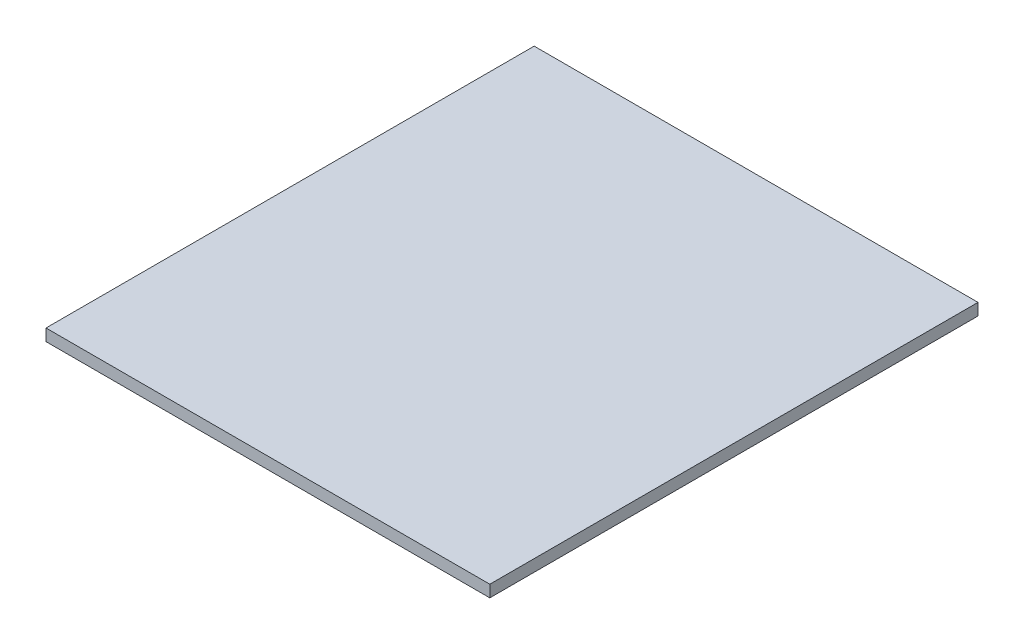
ISO-10303-21;
HEADER;
FILE_DESCRIPTION(('STEP AP214'),'2;1');
FILE_NAME('part.step','',(''),(''),'','','');
FILE_SCHEMA(('AUTOMOTIVE_DESIGN { 1 0 10303 214 1 1 1 1 }'));
ENDSEC;
DATA;
#1=APPLICATION_CONTEXT('core data for automotive mechanical design processes');
#2=APPLICATION_PROTOCOL_DEFINITION('international standard','automotive_design',2000,#1);
#3=PRODUCT_CONTEXT('',#1,'mechanical');
#4=PRODUCT('Part','Part','',(#3));
#5=PRODUCT_RELATED_PRODUCT_CATEGORY('part','',(#4));
#6=PRODUCT_DEFINITION_FORMATION('','',#4);
#7=PRODUCT_DEFINITION_CONTEXT('part definition',#1,'design');
#8=PRODUCT_DEFINITION('design','',#6,#7);
#9=PRODUCT_DEFINITION_SHAPE('','',#8);
#10=(LENGTH_UNIT() NAMED_UNIT(*) SI_UNIT(.MILLI.,.METRE.));
#11=(NAMED_UNIT(*) PLANE_ANGLE_UNIT() SI_UNIT($,.RADIAN.));
#12=(NAMED_UNIT(*) SI_UNIT($,.STERADIAN.) SOLID_ANGLE_UNIT());
#13=UNCERTAINTY_MEASURE_WITH_UNIT(LENGTH_MEASURE(1.E-05),#10,'distance_accuracy_value','');
#14=(GEOMETRIC_REPRESENTATION_CONTEXT(3) GLOBAL_UNCERTAINTY_ASSIGNED_CONTEXT((#13)) GLOBAL_UNIT_ASSIGNED_CONTEXT((#10,
#11,#12)) REPRESENTATION_CONTEXT('',''));
#15=CARTESIAN_POINT('',(0.,0.,0.));
#16=DIRECTION('',(0.,0.,1.));
#17=DIRECTION('',(1.,0.,0.));
#18=AXIS2_PLACEMENT_3D('',#15,#16,#17);
#19=CARTESIAN_POINT('',(50.,4.,0.));
#20=DIRECTION('',(-1.,0.,0.));
#21=DIRECTION('',(0.,0.,1.));
#22=AXIS2_PLACEMENT_3D('',#19,#20,#21);
#23=PLANE('',#22);
#24=DIRECTION('',(0.,1.,0.));
#25=VECTOR('',#24,1.);
#26=CARTESIAN_POINT('',(50.,4.,-510.));
#27=LINE('',#26,#25);
#28=CARTESIAN_POINT('',(50.,4.,-510.));
#29=VERTEX_POINT('',#28);
#30=CARTESIAN_POINT('',(50.,8.,-510.));
#31=VERTEX_POINT('',#30);
#32=EDGE_CURVE('E11',#29,#31,#27,.T.);
#33=ORIENTED_EDGE('',*,*,#32,.F.);
#34=DIRECTION('',(0.,0.,1.));
#35=VECTOR('',#34,1.);
#36=CARTESIAN_POINT('',(50.,4.,0.));
#37=LINE('',#36,#35);
#38=CARTESIAN_POINT('',(50.,4.,-345.));
#39=VERTEX_POINT('',#38);
#40=EDGE_CURVE('E89',#29,#39,#37,.T.);
#41=ORIENTED_EDGE('',*,*,#40,.T.);
#42=DIRECTION('',(0.,1.,0.));
#43=VECTOR('',#42,1.);
#44=CARTESIAN_POINT('',(50.,4.,-345.));
#45=LINE('',#44,#43);
#46=CARTESIAN_POINT('',(50.,8.,-345.));
#47=VERTEX_POINT('',#46);
#48=EDGE_CURVE('E44',#39,#47,#45,.T.);
#49=ORIENTED_EDGE('',*,*,#48,.T.);
#50=DIRECTION('',(0.,0.,1.));
#51=VECTOR('',#50,1.);
#52=CARTESIAN_POINT('',(50.,8.,0.));
#53=LINE('',#52,#51);
#54=EDGE_CURVE('E102',#31,#47,#53,.T.);
#55=ORIENTED_EDGE('',*,*,#54,.F.);
#56=EDGE_LOOP('',(#33,#41,#49,#55));
#57=FACE_BOUND('',#56,.T.);
#58=ADVANCED_FACE('F34',(#57),#23,.T.);
#59=CARTESIAN_POINT('',(0.,4.,-345.));
#60=DIRECTION('',(0.,0.,1.));
#61=DIRECTION('',(1.,0.,0.));
#62=AXIS2_PLACEMENT_3D('',#59,#60,#61);
#63=PLANE('',#62);
#64=ORIENTED_EDGE('',*,*,#48,.F.);
#65=DIRECTION('',(1.,0.,0.));
#66=VECTOR('',#65,1.);
#67=CARTESIAN_POINT('',(0.,4.,-345.));
#68=LINE('',#67,#66);
#69=CARTESIAN_POINT('',(200.,4.,-345.));
#70=VERTEX_POINT('',#69);
#71=EDGE_CURVE('E96',#70,#39,#68,.F.);
#72=ORIENTED_EDGE('',*,*,#71,.F.);
#73=DIRECTION('',(0.,1.,0.));
#74=VECTOR('',#73,1.);
#75=CARTESIAN_POINT('',(200.,4.,-345.));
#76=LINE('',#75,#74);
#77=CARTESIAN_POINT('',(200.,8.,-345.));
#78=VERTEX_POINT('',#77);
#79=EDGE_CURVE('E52',#70,#78,#76,.T.);
#80=ORIENTED_EDGE('',*,*,#79,.T.);
#81=DIRECTION('',(1.,0.,0.));
#82=VECTOR('',#81,1.);
#83=CARTESIAN_POINT('',(0.,8.,-345.));
#84=LINE('',#83,#82);
#85=EDGE_CURVE('E83',#78,#47,#84,.F.);
#86=ORIENTED_EDGE('',*,*,#85,.T.);
#87=EDGE_LOOP('',(#64,#72,#80,#86));
#88=FACE_BOUND('',#87,.T.);
#89=ADVANCED_FACE('F106',(#88),#63,.T.);
#90=CARTESIAN_POINT('',(200.,4.,0.));
#91=DIRECTION('',(-1.,0.,0.));
#92=DIRECTION('',(0.,0.,1.));
#93=AXIS2_PLACEMENT_3D('',#90,#91,#92);
#94=PLANE('',#93);
#95=ORIENTED_EDGE('',*,*,#79,.F.);
#96=DIRECTION('',(0.,0.,1.));
#97=VECTOR('',#96,1.);
#98=CARTESIAN_POINT('',(200.,4.,0.));
#99=LINE('',#98,#97);
#100=CARTESIAN_POINT('',(200.,4.,-510.));
#101=VERTEX_POINT('',#100);
#102=EDGE_CURVE('E88',#70,#101,#99,.F.);
#103=ORIENTED_EDGE('',*,*,#102,.T.);
#104=DIRECTION('',(0.,1.,0.));
#105=VECTOR('',#104,1.);
#106=CARTESIAN_POINT('',(200.,4.,-510.));
#107=LINE('',#106,#105);
#108=CARTESIAN_POINT('',(200.,8.,-510.));
#109=VERTEX_POINT('',#108);
#110=EDGE_CURVE('E38',#101,#109,#107,.T.);
#111=ORIENTED_EDGE('',*,*,#110,.T.);
#112=DIRECTION('',(0.,0.,1.));
#113=VECTOR('',#112,1.);
#114=CARTESIAN_POINT('',(200.,8.,0.));
#115=LINE('',#114,#113);
#116=EDGE_CURVE('E98',#78,#109,#115,.F.);
#117=ORIENTED_EDGE('',*,*,#116,.F.);
#118=EDGE_LOOP('',(#95,#103,#111,#117));
#119=FACE_BOUND('',#118,.T.);
#120=ADVANCED_FACE('F91',(#119),#94,.F.);
#121=CARTESIAN_POINT('',(0.,4.,-510.));
#122=DIRECTION('',(0.,0.,1.));
#123=DIRECTION('',(1.,0.,0.));
#124=AXIS2_PLACEMENT_3D('',#121,#122,#123);
#125=PLANE('',#124);
#126=DIRECTION('',(1.,0.,0.));
#127=VECTOR('',#126,1.);
#128=CARTESIAN_POINT('',(0.,4.,-510.));
#129=LINE('',#128,#127);
#130=EDGE_CURVE('E77',#101,#29,#129,.F.);
#131=ORIENTED_EDGE('',*,*,#130,.T.);
#132=ORIENTED_EDGE('',*,*,#32,.T.);
#133=DIRECTION('',(1.,0.,0.));
#134=VECTOR('',#133,1.);
#135=CARTESIAN_POINT('',(0.,8.,-510.));
#136=LINE('',#135,#134);
#137=EDGE_CURVE('E79',#109,#31,#136,.F.);
#138=ORIENTED_EDGE('',*,*,#137,.F.);
#139=ORIENTED_EDGE('',*,*,#110,.F.);
#140=EDGE_LOOP('',(#131,#132,#138,#139));
#141=FACE_BOUND('',#140,.T.);
#142=ADVANCED_FACE('F36',(#141),#125,.F.);
#143=CARTESIAN_POINT('',(0.,8.,0.));
#144=DIRECTION('',(0.,1.,0.));
#145=DIRECTION('',(0.,0.,1.));
#146=AXIS2_PLACEMENT_3D('',#143,#144,#145);
#147=PLANE('',#146);
#148=ORIENTED_EDGE('',*,*,#116,.T.);
#149=ORIENTED_EDGE('',*,*,#137,.T.);
#150=ORIENTED_EDGE('',*,*,#54,.T.);
#151=ORIENTED_EDGE('',*,*,#85,.F.);
#152=EDGE_LOOP('',(#148,#149,#150,#151));
#153=FACE_BOUND('',#152,.T.);
#154=ADVANCED_FACE('F105',(#153),#147,.T.);
#155=CARTESIAN_POINT('',(0.,4.,0.));
#156=DIRECTION('',(0.,1.,0.));
#157=DIRECTION('',(0.,0.,1.));
#158=AXIS2_PLACEMENT_3D('',#155,#156,#157);
#159=PLANE('',#158);
#160=ORIENTED_EDGE('',*,*,#102,.F.);
#161=ORIENTED_EDGE('',*,*,#71,.T.);
#162=ORIENTED_EDGE('',*,*,#40,.F.);
#163=ORIENTED_EDGE('',*,*,#130,.F.);
#164=EDGE_LOOP('',(#160,#161,#162,#163));
#165=FACE_BOUND('',#164,.T.);
#166=ADVANCED_FACE('F86',(#165),#159,.F.);
#167=CLOSED_SHELL('',(#58,#89,#120,#142,#154,#166));
#168=MANIFOLD_SOLID_BREP('B2',#167);
#169=ADVANCED_BREP_SHAPE_REPRESENTATION('',(#18,#168),#14);
#170=SHAPE_DEFINITION_REPRESENTATION(#9,#169);
ENDSEC;
END-ISO-10303-21;
